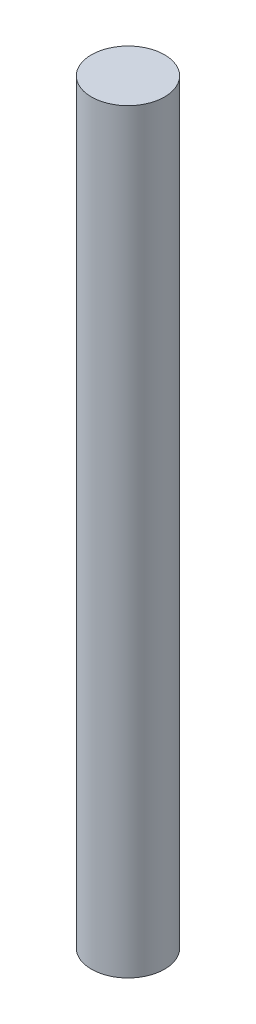
ISO-10303-21;
HEADER;
FILE_DESCRIPTION(('STEP AP214'),'2;1');
FILE_NAME('part.step','',(''),(''),'','','');
FILE_SCHEMA(('AUTOMOTIVE_DESIGN { 1 0 10303 214 1 1 1 1 }'));
ENDSEC;
DATA;
#1=APPLICATION_CONTEXT('core data for automotive mechanical design processes');
#2=APPLICATION_PROTOCOL_DEFINITION('international standard','automotive_design',2000,#1);
#3=PRODUCT_CONTEXT('',#1,'mechanical');
#4=PRODUCT('Part','Part','',(#3));
#5=PRODUCT_RELATED_PRODUCT_CATEGORY('part','',(#4));
#6=PRODUCT_DEFINITION_FORMATION('','',#4);
#7=PRODUCT_DEFINITION_CONTEXT('part definition',#1,'design');
#8=PRODUCT_DEFINITION('design','',#6,#7);
#9=PRODUCT_DEFINITION_SHAPE('','',#8);
#10=(LENGTH_UNIT() NAMED_UNIT(*) SI_UNIT(.MILLI.,.METRE.));
#11=(NAMED_UNIT(*) PLANE_ANGLE_UNIT() SI_UNIT($,.RADIAN.));
#12=(NAMED_UNIT(*) SI_UNIT($,.STERADIAN.) SOLID_ANGLE_UNIT());
#13=UNCERTAINTY_MEASURE_WITH_UNIT(LENGTH_MEASURE(1.E-05),#10,'distance_accuracy_value','');
#14=(GEOMETRIC_REPRESENTATION_CONTEXT(3) GLOBAL_UNCERTAINTY_ASSIGNED_CONTEXT((#13)) GLOBAL_UNIT_ASSIGNED_CONTEXT((#10,
#11,#12)) REPRESENTATION_CONTEXT('',''));
#15=CARTESIAN_POINT('',(0.,0.,0.));
#16=DIRECTION('',(0.,0.,1.));
#17=DIRECTION('',(1.,0.,0.));
#18=AXIS2_PLACEMENT_3D('',#15,#16,#17);
#19=CARTESIAN_POINT('',(0.,31.,0.));
#20=DIRECTION('',(0.,-1.,0.));
#21=DIRECTION('',(0.,0.,-1.));
#22=AXIS2_PLACEMENT_3D('',#19,#20,#21);
#23=CYLINDRICAL_SURFACE('',#22,1.5);
#24=CARTESIAN_POINT('',(0.,31.,0.));
#25=DIRECTION('',(0.,1.,0.));
#26=DIRECTION('',(0.,0.,1.));
#27=AXIS2_PLACEMENT_3D('',#24,#25,#26);
#28=CIRCLE('',#27,1.5);
#29=CARTESIAN_POINT('',(0.,31.,1.5));
#30=VERTEX_POINT('',#29);
#31=EDGE_CURVE('E10',#30,#30,#28,.T.);
#32=ORIENTED_EDGE('',*,*,#31,.F.);
#33=EDGE_LOOP('',(#32));
#34=FACE_BOUND('',#33,.T.);
#35=CARTESIAN_POINT('',(0.,0.,0.));
#36=DIRECTION('',(0.,1.,0.));
#37=DIRECTION('',(0.,0.,1.));
#38=AXIS2_PLACEMENT_3D('',#35,#36,#37);
#39=CIRCLE('',#38,1.5);
#40=CARTESIAN_POINT('',(0.,0.,1.5));
#41=VERTEX_POINT('',#40);
#42=EDGE_CURVE('E34',#41,#41,#39,.T.);
#43=ORIENTED_EDGE('',*,*,#42,.T.);
#44=EDGE_LOOP('',(#43));
#45=FACE_BOUND('',#44,.T.);
#46=ADVANCED_FACE('F31',(#34,#45),#23,.T.);
#47=CARTESIAN_POINT('',(0.,31.,0.));
#48=DIRECTION('',(0.,1.,0.));
#49=DIRECTION('',(0.,0.,1.));
#50=AXIS2_PLACEMENT_3D('',#47,#48,#49);
#51=PLANE('',#50);
#52=ORIENTED_EDGE('',*,*,#31,.T.);
#53=EDGE_LOOP('',(#52));
#54=FACE_BOUND('',#53,.T.);
#55=ADVANCED_FACE('F46',(#54),#51,.T.);
#56=CARTESIAN_POINT('',(0.,0.,0.));
#57=DIRECTION('',(0.,1.,0.));
#58=DIRECTION('',(0.,0.,1.));
#59=AXIS2_PLACEMENT_3D('',#56,#57,#58);
#60=PLANE('',#59);
#61=ORIENTED_EDGE('',*,*,#42,.F.);
#62=EDGE_LOOP('',(#61));
#63=FACE_BOUND('',#62,.T.);
#64=ADVANCED_FACE('F44',(#63),#60,.F.);
#65=CLOSED_SHELL('',(#46,#55,#64));
#66=MANIFOLD_SOLID_BREP('B2',#65);
#67=ADVANCED_BREP_SHAPE_REPRESENTATION('',(#18,#66),#14);
#68=SHAPE_DEFINITION_REPRESENTATION(#9,#67);
ENDSEC;
END-ISO-10303-21;
